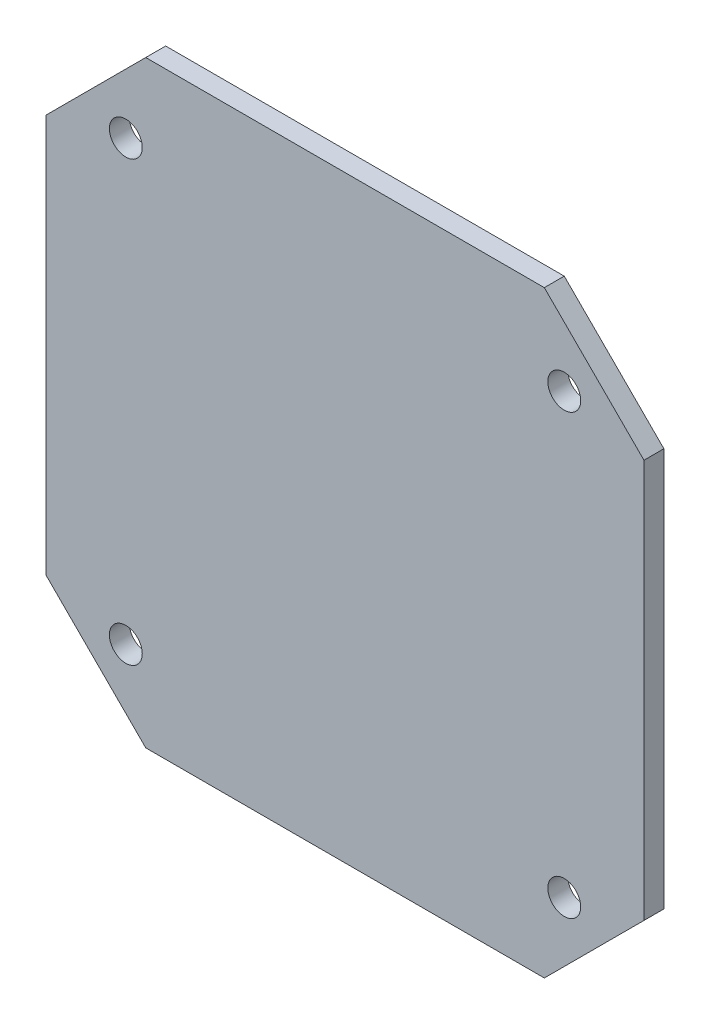
ISO-10303-21;
HEADER;
FILE_DESCRIPTION(('STEP AP214'),'2;1');
FILE_NAME('part.step','',(''),(''),'','','');
FILE_SCHEMA(('AUTOMOTIVE_DESIGN { 1 0 10303 214 1 1 1 1 }'));
ENDSEC;
DATA;
#1=APPLICATION_CONTEXT('core data for automotive mechanical design processes');
#2=APPLICATION_PROTOCOL_DEFINITION('international standard','automotive_design',2000,#1);
#3=PRODUCT_CONTEXT('',#1,'mechanical');
#4=PRODUCT('Part','Part','',(#3));
#5=PRODUCT_RELATED_PRODUCT_CATEGORY('part','',(#4));
#6=PRODUCT_DEFINITION_FORMATION('','',#4);
#7=PRODUCT_DEFINITION_CONTEXT('part definition',#1,'design');
#8=PRODUCT_DEFINITION('design','',#6,#7);
#9=PRODUCT_DEFINITION_SHAPE('','',#8);
#10=(LENGTH_UNIT() NAMED_UNIT(*) SI_UNIT(.MILLI.,.METRE.));
#11=(NAMED_UNIT(*) PLANE_ANGLE_UNIT() SI_UNIT($,.RADIAN.));
#12=(NAMED_UNIT(*) SI_UNIT($,.STERADIAN.) SOLID_ANGLE_UNIT());
#13=UNCERTAINTY_MEASURE_WITH_UNIT(LENGTH_MEASURE(1.E-05),#10,'distance_accuracy_value','');
#14=(GEOMETRIC_REPRESENTATION_CONTEXT(3) GLOBAL_UNCERTAINTY_ASSIGNED_CONTEXT((#13)) GLOBAL_UNIT_ASSIGNED_CONTEXT((#10,
#11,#12)) REPRESENTATION_CONTEXT('',''));
#15=CARTESIAN_POINT('',(0.,0.,0.));
#16=DIRECTION('',(0.,0.,1.));
#17=DIRECTION('',(1.,0.,0.));
#18=AXIS2_PLACEMENT_3D('',#15,#16,#17);
#19=CARTESIAN_POINT('',(30.,30.,2.));
#20=DIRECTION('',(-1.,0.,0.));
#21=DIRECTION('',(0.,-1.,0.));
#22=AXIS2_PLACEMENT_3D('',#19,#20,#21);
#23=PLANE('',#22);
#24=DIRECTION('',(0.,1.,0.));
#25=VECTOR('',#24,1.);
#26=CARTESIAN_POINT('',(30.,30.,0.));
#27=LINE('',#26,#25);
#28=CARTESIAN_POINT('',(30.,-20.,0.));
#29=VERTEX_POINT('',#28);
#30=CARTESIAN_POINT('',(30.,20.,0.));
#31=VERTEX_POINT('',#30);
#32=EDGE_CURVE('E125',#29,#31,#27,.T.);
#33=ORIENTED_EDGE('',*,*,#32,.T.);
#34=DIRECTION('',(0.,0.,-1.));
#35=VECTOR('',#34,1.);
#36=CARTESIAN_POINT('',(30.,20.,80.));
#37=LINE('',#36,#35);
#38=CARTESIAN_POINT('',(30.,20.,2.));
#39=VERTEX_POINT('',#38);
#40=EDGE_CURVE('E105',#39,#31,#37,.T.);
#41=ORIENTED_EDGE('',*,*,#40,.F.);
#42=DIRECTION('',(0.,1.,0.));
#43=VECTOR('',#42,1.);
#44=CARTESIAN_POINT('',(30.,30.,2.));
#45=LINE('',#44,#43);
#46=CARTESIAN_POINT('',(30.,-20.,2.));
#47=VERTEX_POINT('',#46);
#48=EDGE_CURVE('E134',#47,#39,#45,.T.);
#49=ORIENTED_EDGE('',*,*,#48,.F.);
#50=DIRECTION('',(0.,0.,-1.));
#51=VECTOR('',#50,1.);
#52=CARTESIAN_POINT('',(30.,-20.,80.));
#53=LINE('',#52,#51);
#54=EDGE_CURVE('E168',#47,#29,#53,.T.);
#55=ORIENTED_EDGE('',*,*,#54,.T.);
#56=EDGE_LOOP('',(#33,#41,#49,#55));
#57=FACE_BOUND('',#56,.T.);
#58=ADVANCED_FACE('F34',(#57),#23,.F.);
#59=CARTESIAN_POINT('',(-30.,30.,2.));
#60=DIRECTION('',(0.,-1.,0.));
#61=DIRECTION('',(0.,0.,-1.));
#62=AXIS2_PLACEMENT_3D('',#59,#60,#61);
#63=PLANE('',#62);
#64=DIRECTION('',(-1.,0.,0.));
#65=VECTOR('',#64,1.);
#66=CARTESIAN_POINT('',(-30.,30.,0.));
#67=LINE('',#66,#65);
#68=CARTESIAN_POINT('',(20.,30.,0.));
#69=VERTEX_POINT('',#68);
#70=CARTESIAN_POINT('',(-20.,30.,0.));
#71=VERTEX_POINT('',#70);
#72=EDGE_CURVE('E116',#69,#71,#67,.T.);
#73=ORIENTED_EDGE('',*,*,#72,.T.);
#74=DIRECTION('',(0.,0.,-1.));
#75=VECTOR('',#74,1.);
#76=CARTESIAN_POINT('',(-20.,30.,80.));
#77=LINE('',#76,#75);
#78=CARTESIAN_POINT('',(-20.,30.,2.));
#79=VERTEX_POINT('',#78);
#80=EDGE_CURVE('E50',#79,#71,#77,.T.);
#81=ORIENTED_EDGE('',*,*,#80,.F.);
#82=DIRECTION('',(-1.,0.,0.));
#83=VECTOR('',#82,1.);
#84=CARTESIAN_POINT('',(-30.,30.,2.));
#85=LINE('',#84,#83);
#86=CARTESIAN_POINT('',(20.,30.,2.));
#87=VERTEX_POINT('',#86);
#88=EDGE_CURVE('E118',#87,#79,#85,.T.);
#89=ORIENTED_EDGE('',*,*,#88,.F.);
#90=DIRECTION('',(0.,0.,-1.));
#91=VECTOR('',#90,1.);
#92=CARTESIAN_POINT('',(20.,30.,80.));
#93=LINE('',#92,#91);
#94=EDGE_CURVE('E102',#87,#69,#93,.T.);
#95=ORIENTED_EDGE('',*,*,#94,.T.);
#96=EDGE_LOOP('',(#73,#81,#89,#95));
#97=FACE_BOUND('',#96,.T.);
#98=ADVANCED_FACE('F115',(#97),#63,.F.);
#99=CARTESIAN_POINT('',(-30.,30.,2.));
#100=DIRECTION('',(1.,0.,0.));
#101=DIRECTION('',(0.,1.,0.));
#102=AXIS2_PLACEMENT_3D('',#99,#100,#101);
#103=PLANE('',#102);
#104=DIRECTION('',(0.,-1.,0.));
#105=VECTOR('',#104,1.);
#106=CARTESIAN_POINT('',(-30.,30.,0.));
#107=LINE('',#106,#105);
#108=CARTESIAN_POINT('',(-30.,20.,0.));
#109=VERTEX_POINT('',#108);
#110=CARTESIAN_POINT('',(-30.,-20.,0.));
#111=VERTEX_POINT('',#110);
#112=EDGE_CURVE('E124',#109,#111,#107,.T.);
#113=ORIENTED_EDGE('',*,*,#112,.T.);
#114=DIRECTION('',(0.,0.,-1.));
#115=VECTOR('',#114,1.);
#116=CARTESIAN_POINT('',(-30.,-20.,80.));
#117=LINE('',#116,#115);
#118=CARTESIAN_POINT('',(-30.,-20.,2.));
#119=VERTEX_POINT('',#118);
#120=EDGE_CURVE('E58',#119,#111,#117,.T.);
#121=ORIENTED_EDGE('',*,*,#120,.F.);
#122=DIRECTION('',(0.,-1.,0.));
#123=VECTOR('',#122,1.);
#124=CARTESIAN_POINT('',(-30.,30.,2.));
#125=LINE('',#124,#123);
#126=CARTESIAN_POINT('',(-30.,20.,2.));
#127=VERTEX_POINT('',#126);
#128=EDGE_CURVE('E42',#127,#119,#125,.T.);
#129=ORIENTED_EDGE('',*,*,#128,.F.);
#130=DIRECTION('',(0.,0.,-1.));
#131=VECTOR('',#130,1.);
#132=CARTESIAN_POINT('',(-30.,20.,80.));
#133=LINE('',#132,#131);
#134=EDGE_CURVE('E110',#127,#109,#133,.T.);
#135=ORIENTED_EDGE('',*,*,#134,.T.);
#136=EDGE_LOOP('',(#113,#121,#129,#135));
#137=FACE_BOUND('',#136,.T.);
#138=ADVANCED_FACE('F189',(#137),#103,.F.);
#139=CARTESIAN_POINT('',(-30.,-30.,2.));
#140=DIRECTION('',(0.,1.,0.));
#141=DIRECTION('',(0.,0.,1.));
#142=AXIS2_PLACEMENT_3D('',#139,#140,#141);
#143=PLANE('',#142);
#144=DIRECTION('',(1.,0.,0.));
#145=VECTOR('',#144,1.);
#146=CARTESIAN_POINT('',(-30.,-30.,2.));
#147=LINE('',#146,#145);
#148=CARTESIAN_POINT('',(-20.,-30.,2.));
#149=VERTEX_POINT('',#148);
#150=CARTESIAN_POINT('',(20.,-30.,2.));
#151=VERTEX_POINT('',#150);
#152=EDGE_CURVE('E11',#149,#151,#147,.T.);
#153=ORIENTED_EDGE('',*,*,#152,.F.);
#154=DIRECTION('',(0.,0.,-1.));
#155=VECTOR('',#154,1.);
#156=CARTESIAN_POINT('',(-20.,-30.,80.));
#157=LINE('',#156,#155);
#158=CARTESIAN_POINT('',(-20.,-30.,0.));
#159=VERTEX_POINT('',#158);
#160=EDGE_CURVE('E176',#149,#159,#157,.T.);
#161=ORIENTED_EDGE('',*,*,#160,.T.);
#162=DIRECTION('',(1.,0.,0.));
#163=VECTOR('',#162,1.);
#164=CARTESIAN_POINT('',(-30.,-30.,0.));
#165=LINE('',#164,#163);
#166=CARTESIAN_POINT('',(20.,-30.,0.));
#167=VERTEX_POINT('',#166);
#168=EDGE_CURVE('E37',#159,#167,#165,.T.);
#169=ORIENTED_EDGE('',*,*,#168,.T.);
#170=DIRECTION('',(0.,0.,-1.));
#171=VECTOR('',#170,1.);
#172=CARTESIAN_POINT('',(20.,-30.,80.));
#173=LINE('',#172,#171);
#174=EDGE_CURVE('E169',#151,#167,#173,.T.);
#175=ORIENTED_EDGE('',*,*,#174,.F.);
#176=EDGE_LOOP('',(#153,#161,#169,#175));
#177=FACE_BOUND('',#176,.T.);
#178=ADVANCED_FACE('F196',(#177),#143,.F.);
#179=CARTESIAN_POINT('',(0.,0.,2.));
#180=DIRECTION('',(0.,0.,1.));
#181=DIRECTION('',(1.,0.,0.));
#182=AXIS2_PLACEMENT_3D('',#179,#180,#181);
#183=PLANE('',#182);
#184=DIRECTION('',(-0.707106781186548,0.707106781186547,0.));
#185=VECTOR('',#184,1.);
#186=CARTESIAN_POINT('',(-25.,-25.,2.));
#187=LINE('',#186,#185);
#188=EDGE_CURVE('E160',#149,#119,#187,.T.);
#189=ORIENTED_EDGE('',*,*,#188,.F.);
#190=ORIENTED_EDGE('',*,*,#152,.T.);
#191=DIRECTION('',(-0.707106781186548,-0.707106781186548,0.));
#192=VECTOR('',#191,1.);
#193=CARTESIAN_POINT('',(25.,-25.,2.));
#194=LINE('',#193,#192);
#195=EDGE_CURVE('E166',#47,#151,#194,.T.);
#196=ORIENTED_EDGE('',*,*,#195,.F.);
#197=ORIENTED_EDGE('',*,*,#48,.T.);
#198=DIRECTION('',(0.707106781186548,-0.707106781186548,0.));
#199=VECTOR('',#198,1.);
#200=CARTESIAN_POINT('',(25.,25.,2.));
#201=LINE('',#200,#199);
#202=EDGE_CURVE('E164',#87,#39,#201,.T.);
#203=ORIENTED_EDGE('',*,*,#202,.F.);
#204=ORIENTED_EDGE('',*,*,#88,.T.);
#205=DIRECTION('',(0.707106781186547,0.707106781186548,0.));
#206=VECTOR('',#205,1.);
#207=CARTESIAN_POINT('',(-25.,25.,2.));
#208=LINE('',#207,#206);
#209=EDGE_CURVE('E162',#127,#79,#208,.T.);
#210=ORIENTED_EDGE('',*,*,#209,.F.);
#211=ORIENTED_EDGE('',*,*,#128,.T.);
#212=EDGE_LOOP('',(#189,#190,#196,#197,#203,#204,#210,#211));
#213=FACE_BOUND('',#212,.T.);
#214=CARTESIAN_POINT('',(22.,22.,2.));
#215=DIRECTION('',(0.,0.,1.));
#216=DIRECTION('',(1.,0.,0.));
#217=AXIS2_PLACEMENT_3D('',#214,#215,#216);
#218=CIRCLE('',#217,1.64999999999999);
#219=CARTESIAN_POINT('',(23.65,22.,2.));
#220=VERTEX_POINT('',#219);
#221=EDGE_CURVE('E154',#220,#220,#218,.T.);
#222=ORIENTED_EDGE('',*,*,#221,.F.);
#223=EDGE_LOOP('',(#222));
#224=FACE_BOUND('',#223,.T.);
#225=CARTESIAN_POINT('',(22.,-22.,2.));
#226=DIRECTION('',(0.,0.,1.));
#227=DIRECTION('',(1.,0.,0.));
#228=AXIS2_PLACEMENT_3D('',#225,#226,#227);
#229=CIRCLE('',#228,1.64999999999999);
#230=CARTESIAN_POINT('',(23.65,-22.,2.));
#231=VERTEX_POINT('',#230);
#232=EDGE_CURVE('E148',#231,#231,#229,.T.);
#233=ORIENTED_EDGE('',*,*,#232,.F.);
#234=EDGE_LOOP('',(#233));
#235=FACE_BOUND('',#234,.T.);
#236=CARTESIAN_POINT('',(-22.,-22.,2.));
#237=DIRECTION('',(0.,0.,1.));
#238=DIRECTION('',(1.,0.,0.));
#239=AXIS2_PLACEMENT_3D('',#236,#237,#238);
#240=CIRCLE('',#239,1.64999999999999);
#241=CARTESIAN_POINT('',(-20.35,-22.,2.));
#242=VERTEX_POINT('',#241);
#243=EDGE_CURVE('E142',#242,#242,#240,.T.);
#244=ORIENTED_EDGE('',*,*,#243,.F.);
#245=EDGE_LOOP('',(#244));
#246=FACE_BOUND('',#245,.T.);
#247=CARTESIAN_POINT('',(-22.,22.,2.));
#248=DIRECTION('',(0.,0.,1.));
#249=DIRECTION('',(1.,0.,0.));
#250=AXIS2_PLACEMENT_3D('',#247,#248,#249);
#251=CIRCLE('',#250,1.64999999999999);
#252=CARTESIAN_POINT('',(-20.35,22.,2.));
#253=VERTEX_POINT('',#252);
#254=EDGE_CURVE('E128',#253,#253,#251,.T.);
#255=ORIENTED_EDGE('',*,*,#254,.F.);
#256=EDGE_LOOP('',(#255));
#257=FACE_BOUND('',#256,.T.);
#258=ADVANCED_FACE('F200',(#213,#224,#235,#246,#257),#183,.T.);
#259=CARTESIAN_POINT('',(0.,0.,0.));
#260=DIRECTION('',(0.,0.,1.));
#261=DIRECTION('',(1.,0.,0.));
#262=AXIS2_PLACEMENT_3D('',#259,#260,#261);
#263=PLANE('',#262);
#264=CARTESIAN_POINT('',(22.,22.,0.));
#265=DIRECTION('',(0.,0.,-1.));
#266=DIRECTION('',(-1.,0.,0.));
#267=AXIS2_PLACEMENT_3D('',#264,#265,#266);
#268=CIRCLE('',#267,1.64999999999999);
#269=CARTESIAN_POINT('',(20.35,22.,0.));
#270=VERTEX_POINT('',#269);
#271=EDGE_CURVE('E157',#270,#270,#268,.T.);
#272=ORIENTED_EDGE('',*,*,#271,.F.);
#273=EDGE_LOOP('',(#272));
#274=FACE_BOUND('',#273,.T.);
#275=CARTESIAN_POINT('',(22.,-22.,0.));
#276=DIRECTION('',(0.,0.,-1.));
#277=DIRECTION('',(-1.,0.,0.));
#278=AXIS2_PLACEMENT_3D('',#275,#276,#277);
#279=CIRCLE('',#278,1.64999999999999);
#280=CARTESIAN_POINT('',(20.35,-22.,0.));
#281=VERTEX_POINT('',#280);
#282=EDGE_CURVE('E151',#281,#281,#279,.T.);
#283=ORIENTED_EDGE('',*,*,#282,.F.);
#284=EDGE_LOOP('',(#283));
#285=FACE_BOUND('',#284,.T.);
#286=CARTESIAN_POINT('',(-22.,-22.,0.));
#287=DIRECTION('',(0.,0.,-1.));
#288=DIRECTION('',(-1.,0.,0.));
#289=AXIS2_PLACEMENT_3D('',#286,#287,#288);
#290=CIRCLE('',#289,1.64999999999999);
#291=CARTESIAN_POINT('',(-23.65,-22.,0.));
#292=VERTEX_POINT('',#291);
#293=EDGE_CURVE('E145',#292,#292,#290,.T.);
#294=ORIENTED_EDGE('',*,*,#293,.F.);
#295=EDGE_LOOP('',(#294));
#296=FACE_BOUND('',#295,.T.);
#297=CARTESIAN_POINT('',(-22.,22.,0.));
#298=DIRECTION('',(0.,0.,-1.));
#299=DIRECTION('',(-1.,0.,0.));
#300=AXIS2_PLACEMENT_3D('',#297,#298,#299);
#301=CIRCLE('',#300,1.64999999999999);
#302=CARTESIAN_POINT('',(-23.65,22.,0.));
#303=VERTEX_POINT('',#302);
#304=EDGE_CURVE('E139',#303,#303,#301,.T.);
#305=ORIENTED_EDGE('',*,*,#304,.F.);
#306=EDGE_LOOP('',(#305));
#307=FACE_BOUND('',#306,.T.);
#308=ORIENTED_EDGE('',*,*,#168,.F.);
#309=DIRECTION('',(0.707106781186548,-0.707106781186547,0.));
#310=VECTOR('',#309,1.);
#311=CARTESIAN_POINT('',(-30.,-20.,0.));
#312=LINE('',#311,#310);
#313=EDGE_CURVE('E177',#111,#159,#312,.T.);
#314=ORIENTED_EDGE('',*,*,#313,.F.);
#315=ORIENTED_EDGE('',*,*,#112,.F.);
#316=DIRECTION('',(-0.707106781186547,-0.707106781186548,0.));
#317=VECTOR('',#316,1.);
#318=CARTESIAN_POINT('',(-20.,30.,0.));
#319=LINE('',#318,#317);
#320=EDGE_CURVE('E123',#71,#109,#319,.T.);
#321=ORIENTED_EDGE('',*,*,#320,.F.);
#322=ORIENTED_EDGE('',*,*,#72,.F.);
#323=DIRECTION('',(-0.707106781186547,0.707106781186547,0.));
#324=VECTOR('',#323,1.);
#325=CARTESIAN_POINT('',(24.9985530675408,25.0014469324592,0.));
#326=LINE('',#325,#324);
#327=EDGE_CURVE('E99',#31,#69,#326,.T.);
#328=ORIENTED_EDGE('',*,*,#327,.F.);
#329=ORIENTED_EDGE('',*,*,#32,.F.);
#330=DIRECTION('',(0.707106781186548,0.707106781186548,0.));
#331=VECTOR('',#330,1.);
#332=CARTESIAN_POINT('',(30.,-20.,0.));
#333=LINE('',#332,#331);
#334=EDGE_CURVE('E171',#167,#29,#333,.T.);
#335=ORIENTED_EDGE('',*,*,#334,.F.);
#336=EDGE_LOOP('',(#308,#314,#315,#321,#322,#328,#329,#335));
#337=FACE_BOUND('',#336,.T.);
#338=ADVANCED_FACE('F121',(#274,#285,#296,#307,#337),#263,.F.);
#339=CARTESIAN_POINT('',(-22.,22.,0.));
#340=DIRECTION('',(0.,0.,-1.));
#341=DIRECTION('',(-1.,0.,0.));
#342=AXIS2_PLACEMENT_3D('',#339,#340,#341);
#343=CYLINDRICAL_SURFACE('',#342,1.64999999999999);
#344=ORIENTED_EDGE('',*,*,#254,.T.);
#345=EDGE_LOOP('',(#344));
#346=FACE_BOUND('',#345,.T.);
#347=ORIENTED_EDGE('',*,*,#304,.T.);
#348=EDGE_LOOP('',(#347));
#349=FACE_BOUND('',#348,.T.);
#350=ADVANCED_FACE('F231',(#346,#349),#343,.F.);
#351=CARTESIAN_POINT('',(-22.,-22.,0.));
#352=DIRECTION('',(0.,0.,-1.));
#353=DIRECTION('',(-1.,0.,0.));
#354=AXIS2_PLACEMENT_3D('',#351,#352,#353);
#355=CYLINDRICAL_SURFACE('',#354,1.64999999999999);
#356=ORIENTED_EDGE('',*,*,#243,.T.);
#357=EDGE_LOOP('',(#356));
#358=FACE_BOUND('',#357,.T.);
#359=ORIENTED_EDGE('',*,*,#293,.T.);
#360=EDGE_LOOP('',(#359));
#361=FACE_BOUND('',#360,.T.);
#362=ADVANCED_FACE('F237',(#358,#361),#355,.F.);
#363=CARTESIAN_POINT('',(22.,-22.,0.));
#364=DIRECTION('',(0.,0.,-1.));
#365=DIRECTION('',(-1.,0.,0.));
#366=AXIS2_PLACEMENT_3D('',#363,#364,#365);
#367=CYLINDRICAL_SURFACE('',#366,1.64999999999999);
#368=ORIENTED_EDGE('',*,*,#232,.T.);
#369=EDGE_LOOP('',(#368));
#370=FACE_BOUND('',#369,.T.);
#371=ORIENTED_EDGE('',*,*,#282,.T.);
#372=EDGE_LOOP('',(#371));
#373=FACE_BOUND('',#372,.T.);
#374=ADVANCED_FACE('F214',(#370,#373),#367,.F.);
#375=CARTESIAN_POINT('',(22.,22.,0.));
#376=DIRECTION('',(0.,0.,-1.));
#377=DIRECTION('',(-1.,0.,0.));
#378=AXIS2_PLACEMENT_3D('',#375,#376,#377);
#379=CYLINDRICAL_SURFACE('',#378,1.64999999999999);
#380=ORIENTED_EDGE('',*,*,#221,.T.);
#381=EDGE_LOOP('',(#380));
#382=FACE_BOUND('',#381,.T.);
#383=ORIENTED_EDGE('',*,*,#271,.T.);
#384=EDGE_LOOP('',(#383));
#385=FACE_BOUND('',#384,.T.);
#386=ADVANCED_FACE('F207',(#382,#385),#379,.F.);
#387=CARTESIAN_POINT('',(30.,-20.,80.));
#388=DIRECTION('',(-0.707106781186548,0.707106781186548,0.));
#389=DIRECTION('',(-0.707106781186548,-0.707106781186548,0.));
#390=AXIS2_PLACEMENT_3D('',#387,#388,#389);
#391=PLANE('',#390);
#392=ORIENTED_EDGE('',*,*,#195,.T.);
#393=ORIENTED_EDGE('',*,*,#174,.T.);
#394=ORIENTED_EDGE('',*,*,#334,.T.);
#395=ORIENTED_EDGE('',*,*,#54,.F.);
#396=EDGE_LOOP('',(#392,#393,#394,#395));
#397=FACE_BOUND('',#396,.T.);
#398=ADVANCED_FACE('F205',(#397),#391,.F.);
#399=CARTESIAN_POINT('',(24.9985530675408,25.0014469324592,80.));
#400=DIRECTION('',(-0.707106781186548,-0.707106781186548,0.));
#401=DIRECTION('',(0.707106781186548,-0.707106781186548,0.));
#402=AXIS2_PLACEMENT_3D('',#399,#400,#401);
#403=PLANE('',#402);
#404=ORIENTED_EDGE('',*,*,#202,.T.);
#405=ORIENTED_EDGE('',*,*,#40,.T.);
#406=ORIENTED_EDGE('',*,*,#327,.T.);
#407=ORIENTED_EDGE('',*,*,#94,.F.);
#408=EDGE_LOOP('',(#404,#405,#406,#407));
#409=FACE_BOUND('',#408,.T.);
#410=ADVANCED_FACE('F101',(#409),#403,.F.);
#411=CARTESIAN_POINT('',(-20.,30.,80.));
#412=DIRECTION('',(0.707106781186548,-0.707106781186547,0.));
#413=DIRECTION('',(0.707106781186547,0.707106781186548,0.));
#414=AXIS2_PLACEMENT_3D('',#411,#412,#413);
#415=PLANE('',#414);
#416=ORIENTED_EDGE('',*,*,#209,.T.);
#417=ORIENTED_EDGE('',*,*,#80,.T.);
#418=ORIENTED_EDGE('',*,*,#320,.T.);
#419=ORIENTED_EDGE('',*,*,#134,.F.);
#420=EDGE_LOOP('',(#416,#417,#418,#419));
#421=FACE_BOUND('',#420,.T.);
#422=ADVANCED_FACE('F185',(#421),#415,.F.);
#423=CARTESIAN_POINT('',(-30.,-20.,80.));
#424=DIRECTION('',(0.707106781186547,0.707106781186548,0.));
#425=DIRECTION('',(-0.707106781186548,0.707106781186547,0.));
#426=AXIS2_PLACEMENT_3D('',#423,#424,#425);
#427=PLANE('',#426);
#428=ORIENTED_EDGE('',*,*,#188,.T.);
#429=ORIENTED_EDGE('',*,*,#120,.T.);
#430=ORIENTED_EDGE('',*,*,#313,.T.);
#431=ORIENTED_EDGE('',*,*,#160,.F.);
#432=EDGE_LOOP('',(#428,#429,#430,#431));
#433=FACE_BOUND('',#432,.T.);
#434=ADVANCED_FACE('F192',(#433),#427,.F.);
#435=CLOSED_SHELL('',(#58,#98,#138,#178,#258,#338,#350,#362,#374,#386,#398,#410,#422,#434));
#436=MANIFOLD_SOLID_BREP('B2',#435);
#437=ADVANCED_BREP_SHAPE_REPRESENTATION('',(#18,#436),#14);
#438=SHAPE_DEFINITION_REPRESENTATION(#9,#437);
ENDSEC;
END-ISO-10303-21;
